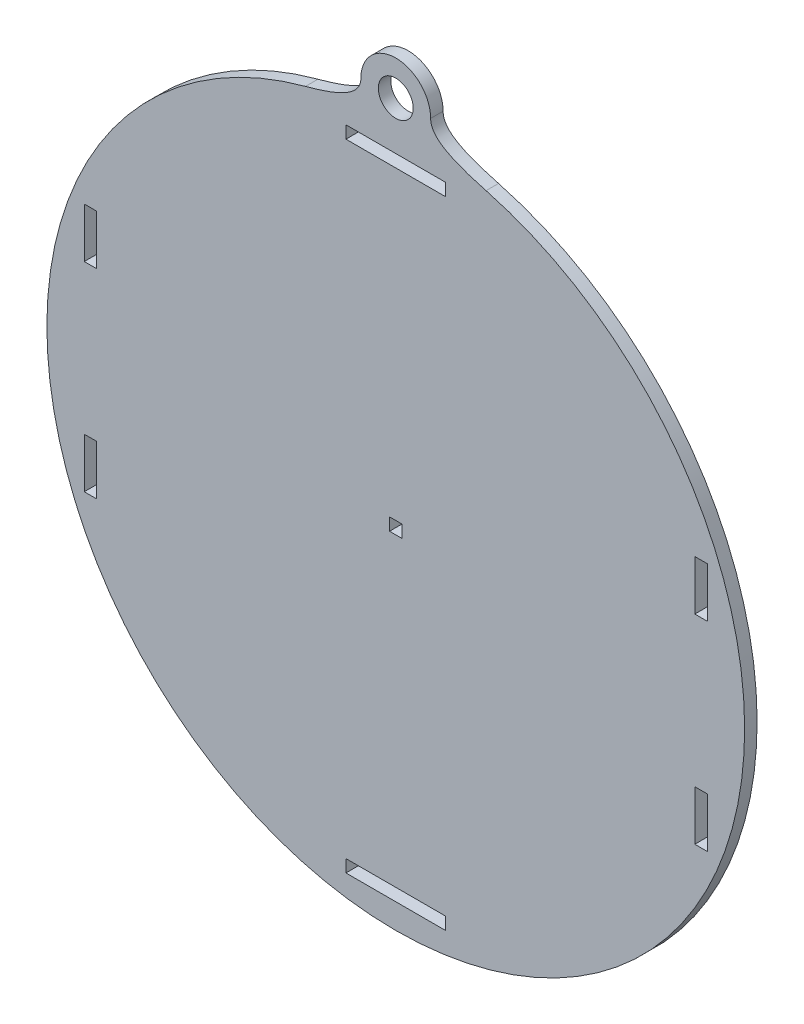
ISO-10303-21;
HEADER;
FILE_DESCRIPTION(('STEP AP214'),'2;1');
FILE_NAME('part.step','',(''),(''),'','','');
FILE_SCHEMA(('AUTOMOTIVE_DESIGN { 1 0 10303 214 1 1 1 1 }'));
ENDSEC;
DATA;
#1=APPLICATION_CONTEXT('core data for automotive mechanical design processes');
#2=APPLICATION_PROTOCOL_DEFINITION('international standard','automotive_design',2000,#1);
#3=PRODUCT_CONTEXT('',#1,'mechanical');
#4=PRODUCT('Part','Part','',(#3));
#5=PRODUCT_RELATED_PRODUCT_CATEGORY('part','',(#4));
#6=PRODUCT_DEFINITION_FORMATION('','',#4);
#7=PRODUCT_DEFINITION_CONTEXT('part definition',#1,'design');
#8=PRODUCT_DEFINITION('design','',#6,#7);
#9=PRODUCT_DEFINITION_SHAPE('','',#8);
#10=(LENGTH_UNIT() NAMED_UNIT(*) SI_UNIT(.MILLI.,.METRE.));
#11=(NAMED_UNIT(*) PLANE_ANGLE_UNIT() SI_UNIT($,.RADIAN.));
#12=(NAMED_UNIT(*) SI_UNIT($,.STERADIAN.) SOLID_ANGLE_UNIT());
#13=UNCERTAINTY_MEASURE_WITH_UNIT(LENGTH_MEASURE(1.E-05),#10,'distance_accuracy_value','');
#14=(GEOMETRIC_REPRESENTATION_CONTEXT(3) GLOBAL_UNCERTAINTY_ASSIGNED_CONTEXT((#13)) GLOBAL_UNIT_ASSIGNED_CONTEXT((#10,
#11,#12)) REPRESENTATION_CONTEXT('',''));
#15=CARTESIAN_POINT('',(0.,0.,0.));
#16=DIRECTION('',(0.,0.,1.));
#17=DIRECTION('',(1.,0.,0.));
#18=AXIS2_PLACEMENT_3D('',#15,#16,#17);
#19=CARTESIAN_POINT('',(-12.8826920563394,89.5500564252986,3.175));
#20=DIRECTION('',(0.,0.,-1.));
#21=DIRECTION('',(-1.,0.,0.));
#22=AXIS2_PLACEMENT_3D('',#19,#20,#21);
#23=PLANE('',#22);
#24=DIRECTION('',(-1.,0.,0.));
#25=VECTOR('',#24,1.);
#26=CARTESIAN_POINT('',(-12.7,-79.375,3.175));
#27=LINE('',#26,#25);
#28=CARTESIAN_POINT('',(12.7,-79.375,3.175));
#29=VERTEX_POINT('',#28);
#30=CARTESIAN_POINT('',(-12.7,-79.375,3.175));
#31=VERTEX_POINT('',#30);
#32=EDGE_CURVE('E244',#29,#31,#27,.T.);
#33=ORIENTED_EDGE('',*,*,#32,.F.);
#34=DIRECTION('',(0.,1.,0.));
#35=VECTOR('',#34,1.);
#36=CARTESIAN_POINT('',(12.7,-79.375,3.175));
#37=LINE('',#36,#35);
#38=CARTESIAN_POINT('',(12.7,-82.55,3.175));
#39=VERTEX_POINT('',#38);
#40=EDGE_CURVE('E267',#39,#29,#37,.T.);
#41=ORIENTED_EDGE('',*,*,#40,.F.);
#42=DIRECTION('',(1.,0.,0.));
#43=VECTOR('',#42,1.);
#44=CARTESIAN_POINT('',(-12.7,-82.55,3.175));
#45=LINE('',#44,#43);
#46=CARTESIAN_POINT('',(-12.7,-82.55,3.175));
#47=VERTEX_POINT('',#46);
#48=EDGE_CURVE('E265',#47,#39,#45,.T.);
#49=ORIENTED_EDGE('',*,*,#48,.F.);
#50=DIRECTION('',(0.,-1.,0.));
#51=VECTOR('',#50,1.);
#52=CARTESIAN_POINT('',(-12.7,-79.375,3.175));
#53=LINE('',#52,#51);
#54=EDGE_CURVE('E252',#31,#47,#53,.T.);
#55=ORIENTED_EDGE('',*,*,#54,.F.);
#56=EDGE_LOOP('',(#33,#41,#49,#55));
#57=FACE_BOUND('',#56,.T.);
#58=DIRECTION('',(0.,-1.,0.));
#59=VECTOR('',#58,1.);
#60=CARTESIAN_POINT('',(-79.375,31.73476,3.175));
#61=LINE('',#60,#59);
#62=CARTESIAN_POINT('',(-79.375,31.73476,3.175));
#63=VERTEX_POINT('',#62);
#64=CARTESIAN_POINT('',(-79.375,19.0347599999999,3.175));
#65=VERTEX_POINT('',#64);
#66=EDGE_CURVE('E314',#63,#65,#61,.T.);
#67=ORIENTED_EDGE('',*,*,#66,.F.);
#68=DIRECTION('',(-1.,0.,0.));
#69=VECTOR('',#68,1.);
#70=CARTESIAN_POINT('',(-79.375,31.73476,3.175));
#71=LINE('',#70,#69);
#72=CARTESIAN_POINT('',(-76.2,31.73476,3.175));
#73=VERTEX_POINT('',#72);
#74=EDGE_CURVE('E322',#73,#63,#71,.T.);
#75=ORIENTED_EDGE('',*,*,#74,.F.);
#76=DIRECTION('',(0.,1.,0.));
#77=VECTOR('',#76,1.);
#78=CARTESIAN_POINT('',(-76.2,31.73476,3.175));
#79=LINE('',#78,#77);
#80=CARTESIAN_POINT('',(-76.2,19.03476,3.175));
#81=VERTEX_POINT('',#80);
#82=EDGE_CURVE('E319',#81,#73,#79,.T.);
#83=ORIENTED_EDGE('',*,*,#82,.F.);
#84=DIRECTION('',(1.,0.,0.));
#85=VECTOR('',#84,1.);
#86=CARTESIAN_POINT('',(-79.375,19.0347599999999,3.175));
#87=LINE('',#86,#85);
#88=EDGE_CURVE('E316',#65,#81,#87,.T.);
#89=ORIENTED_EDGE('',*,*,#88,.F.);
#90=EDGE_LOOP('',(#67,#75,#83,#89));
#91=FACE_BOUND('',#90,.T.);
#92=DIRECTION('',(0.,1.,0.));
#93=VECTOR('',#92,1.);
#94=CARTESIAN_POINT('',(79.375,-19.06524,3.175));
#95=LINE('',#94,#93);
#96=CARTESIAN_POINT('',(79.3749999999999,-31.76524,3.175));
#97=VERTEX_POINT('',#96);
#98=CARTESIAN_POINT('',(79.375,-19.06524,3.175));
#99=VERTEX_POINT('',#98);
#100=EDGE_CURVE('E376',#97,#99,#95,.T.);
#101=ORIENTED_EDGE('',*,*,#100,.F.);
#102=DIRECTION('',(1.,0.,0.));
#103=VECTOR('',#102,1.);
#104=CARTESIAN_POINT('',(79.3749999999999,-31.76524,3.175));
#105=LINE('',#104,#103);
#106=CARTESIAN_POINT('',(76.2,-31.76524,3.175));
#107=VERTEX_POINT('',#106);
#108=EDGE_CURVE('E384',#107,#97,#105,.T.);
#109=ORIENTED_EDGE('',*,*,#108,.F.);
#110=DIRECTION('',(0.,-1.,0.));
#111=VECTOR('',#110,1.);
#112=CARTESIAN_POINT('',(76.2,-19.06524,3.175));
#113=LINE('',#112,#111);
#114=CARTESIAN_POINT('',(76.2,-19.06524,3.175));
#115=VERTEX_POINT('',#114);
#116=EDGE_CURVE('E381',#115,#107,#113,.T.);
#117=ORIENTED_EDGE('',*,*,#116,.F.);
#118=DIRECTION('',(-1.,0.,0.));
#119=VECTOR('',#118,1.);
#120=CARTESIAN_POINT('',(79.375,-19.06524,3.175));
#121=LINE('',#120,#119);
#122=EDGE_CURVE('E378',#99,#115,#121,.T.);
#123=ORIENTED_EDGE('',*,*,#122,.F.);
#124=EDGE_LOOP('',(#101,#109,#117,#123));
#125=FACE_BOUND('',#124,.T.);
#126=DIRECTION('',(0.,1.,0.));
#127=VECTOR('',#126,1.);
#128=CARTESIAN_POINT('',(1.5875,-1.5875,3.175));
#129=LINE('',#128,#127);
#130=CARTESIAN_POINT('',(1.5875,-1.5875,3.175));
#131=VERTEX_POINT('',#130);
#132=CARTESIAN_POINT('',(1.5875,1.5875,3.175));
#133=VERTEX_POINT('',#132);
#134=EDGE_CURVE('E438',#131,#133,#129,.T.);
#135=ORIENTED_EDGE('',*,*,#134,.F.);
#136=DIRECTION('',(1.,0.,0.));
#137=VECTOR('',#136,1.);
#138=CARTESIAN_POINT('',(-1.5875,-1.5875,3.175));
#139=LINE('',#138,#137);
#140=CARTESIAN_POINT('',(-1.5875,-1.58750000000001,3.175));
#141=VERTEX_POINT('',#140);
#142=EDGE_CURVE('E446',#141,#131,#139,.T.);
#143=ORIENTED_EDGE('',*,*,#142,.F.);
#144=DIRECTION('',(0.,-1.,0.));
#145=VECTOR('',#144,1.);
#146=CARTESIAN_POINT('',(-1.5875,-1.5875,3.175));
#147=LINE('',#146,#145);
#148=CARTESIAN_POINT('',(-1.5875,1.5875,3.175));
#149=VERTEX_POINT('',#148);
#150=EDGE_CURVE('E443',#149,#141,#147,.T.);
#151=ORIENTED_EDGE('',*,*,#150,.F.);
#152=DIRECTION('',(-1.,0.,0.));
#153=VECTOR('',#152,1.);
#154=CARTESIAN_POINT('',(-1.5875,1.5875,3.175));
#155=LINE('',#154,#153);
#156=EDGE_CURVE('E440',#133,#149,#155,.T.);
#157=ORIENTED_EDGE('',*,*,#156,.F.);
#158=EDGE_LOOP('',(#135,#143,#151,#157));
#159=FACE_BOUND('',#158,.T.);
#160=CARTESIAN_POINT('',(-8.89,94.7608059570981,3.175));
#161=CARTESIAN_POINT('',(-8.88999999999996,90.5274726237649,3.175));
#162=CARTESIAN_POINT('',(-14.8308411137003,88.0621405389661,3.175));
#163=CARTESIAN_POINT('',(-23.0090131096144,85.8708059570981,3.175));
#164=B_SPLINE_CURVE_WITH_KNOTS('',3,(#160,#161,#162,#163),.UNSPECIFIED.,.F.,.F.,(4,4),(0.,1.),.UNSPECIFIED.);
#165=CARTESIAN_POINT('',(-8.89,94.7608059570981,3.175));
#166=VERTEX_POINT('',#165);
#167=CARTESIAN_POINT('',(-23.0090131096144,85.8708059570981,3.175));
#168=VERTEX_POINT('',#167);
#169=EDGE_CURVE('E468',#166,#168,#164,.T.);
#170=ORIENTED_EDGE('',*,*,#169,.T.);
#171=CARTESIAN_POINT('',(0.,0.,3.175));
#172=DIRECTION('',(0.,0.,1.));
#173=DIRECTION('',(1.,0.,0.));
#174=AXIS2_PLACEMENT_3D('',#171,#172,#173);
#175=CIRCLE('',#174,88.9);
#176=CARTESIAN_POINT('',(23.0090131096145,85.8708059570981,3.175));
#177=VERTEX_POINT('',#176);
#178=EDGE_CURVE('E474',#168,#177,#175,.T.);
#179=ORIENTED_EDGE('',*,*,#178,.T.);
#180=CARTESIAN_POINT('',(23.0090131096145,85.8708059570981,3.175));
#181=CARTESIAN_POINT('',(14.8308411137004,88.0621405389661,3.175));
#182=CARTESIAN_POINT('',(8.88999999999998,90.5274726237648,3.175));
#183=CARTESIAN_POINT('',(8.89,94.7608059570981,3.175));
#184=B_SPLINE_CURVE_WITH_KNOTS('',3,(#180,#181,#182,#183),.UNSPECIFIED.,.F.,.F.,(4,4),(0.,1.),.UNSPECIFIED.);
#185=CARTESIAN_POINT('',(8.89,94.7608059570981,3.175));
#186=VERTEX_POINT('',#185);
#187=EDGE_CURVE('E480',#177,#186,#184,.T.);
#188=ORIENTED_EDGE('',*,*,#187,.T.);
#189=CARTESIAN_POINT('',(0.,94.7608059570981,3.175));
#190=DIRECTION('',(0.,0.,1.));
#191=DIRECTION('',(-1.,0.,0.));
#192=AXIS2_PLACEMENT_3D('',#189,#190,#191);
#193=CIRCLE('',#192,8.89);
#194=EDGE_CURVE('E485',#186,#166,#193,.T.);
#195=ORIENTED_EDGE('',*,*,#194,.T.);
#196=EDGE_LOOP('',(#170,#179,#188,#195));
#197=FACE_BOUND('',#196,.T.);
#198=DIRECTION('',(0.,1.,0.));
#199=VECTOR('',#198,1.);
#200=CARTESIAN_POINT('',(79.375,31.73476,3.175));
#201=LINE('',#200,#199);
#202=CARTESIAN_POINT('',(79.375,19.0347599999999,3.175));
#203=VERTEX_POINT('',#202);
#204=CARTESIAN_POINT('',(79.375,31.73476,3.175));
#205=VERTEX_POINT('',#204);
#206=EDGE_CURVE('E407',#203,#205,#201,.T.);
#207=ORIENTED_EDGE('',*,*,#206,.F.);
#208=DIRECTION('',(1.,0.,0.));
#209=VECTOR('',#208,1.);
#210=CARTESIAN_POINT('',(79.375,19.0347599999999,3.175));
#211=LINE('',#210,#209);
#212=CARTESIAN_POINT('',(76.2,19.03476,3.175));
#213=VERTEX_POINT('',#212);
#214=EDGE_CURVE('E415',#213,#203,#211,.T.);
#215=ORIENTED_EDGE('',*,*,#214,.F.);
#216=DIRECTION('',(0.,-1.,0.));
#217=VECTOR('',#216,1.);
#218=CARTESIAN_POINT('',(76.2,31.73476,3.175));
#219=LINE('',#218,#217);
#220=CARTESIAN_POINT('',(76.2,31.73476,3.175));
#221=VERTEX_POINT('',#220);
#222=EDGE_CURVE('E412',#221,#213,#219,.T.);
#223=ORIENTED_EDGE('',*,*,#222,.F.);
#224=DIRECTION('',(-1.,0.,0.));
#225=VECTOR('',#224,1.);
#226=CARTESIAN_POINT('',(79.375,31.73476,3.175));
#227=LINE('',#226,#225);
#228=EDGE_CURVE('E409',#205,#221,#227,.T.);
#229=ORIENTED_EDGE('',*,*,#228,.F.);
#230=EDGE_LOOP('',(#207,#215,#223,#229));
#231=FACE_BOUND('',#230,.T.);
#232=DIRECTION('',(0.,-1.,0.));
#233=VECTOR('',#232,1.);
#234=CARTESIAN_POINT('',(-79.375,-19.06524,3.175));
#235=LINE('',#234,#233);
#236=CARTESIAN_POINT('',(-79.375,-19.06524,3.175));
#237=VERTEX_POINT('',#236);
#238=CARTESIAN_POINT('',(-79.3749999999999,-31.76524,3.175));
#239=VERTEX_POINT('',#238);
#240=EDGE_CURVE('E345',#237,#239,#235,.T.);
#241=ORIENTED_EDGE('',*,*,#240,.F.);
#242=DIRECTION('',(-1.,0.,0.));
#243=VECTOR('',#242,1.);
#244=CARTESIAN_POINT('',(-79.375,-19.06524,3.175));
#245=LINE('',#244,#243);
#246=CARTESIAN_POINT('',(-76.2,-19.06524,3.175));
#247=VERTEX_POINT('',#246);
#248=EDGE_CURVE('E353',#247,#237,#245,.T.);
#249=ORIENTED_EDGE('',*,*,#248,.F.);
#250=DIRECTION('',(0.,1.,0.));
#251=VECTOR('',#250,1.);
#252=CARTESIAN_POINT('',(-76.2,-19.06524,3.175));
#253=LINE('',#252,#251);
#254=CARTESIAN_POINT('',(-76.2,-31.76524,3.175));
#255=VERTEX_POINT('',#254);
#256=EDGE_CURVE('E350',#255,#247,#253,.T.);
#257=ORIENTED_EDGE('',*,*,#256,.F.);
#258=DIRECTION('',(1.,0.,0.));
#259=VECTOR('',#258,1.);
#260=CARTESIAN_POINT('',(-79.3749999999999,-31.76524,3.175));
#261=LINE('',#260,#259);
#262=EDGE_CURVE('E347',#239,#255,#261,.T.);
#263=ORIENTED_EDGE('',*,*,#262,.F.);
#264=EDGE_LOOP('',(#241,#249,#257,#263));
#265=FACE_BOUND('',#264,.T.);
#266=DIRECTION('',(-1.,0.,0.));
#267=VECTOR('',#266,1.);
#268=CARTESIAN_POINT('',(-12.7,82.55,3.175));
#269=LINE('',#268,#267);
#270=CARTESIAN_POINT('',(12.7,82.55,3.175));
#271=VERTEX_POINT('',#270);
#272=CARTESIAN_POINT('',(-12.7,82.55,3.175));
#273=VERTEX_POINT('',#272);
#274=EDGE_CURVE('E283',#271,#273,#269,.T.);
#275=ORIENTED_EDGE('',*,*,#274,.F.);
#276=DIRECTION('',(0.,1.,0.));
#277=VECTOR('',#276,1.);
#278=CARTESIAN_POINT('',(12.7,82.55,3.175));
#279=LINE('',#278,#277);
#280=CARTESIAN_POINT('',(12.7,79.375,3.175));
#281=VERTEX_POINT('',#280);
#282=EDGE_CURVE('E291',#281,#271,#279,.T.);
#283=ORIENTED_EDGE('',*,*,#282,.F.);
#284=DIRECTION('',(1.,0.,0.));
#285=VECTOR('',#284,1.);
#286=CARTESIAN_POINT('',(-12.7,79.375,3.175));
#287=LINE('',#286,#285);
#288=CARTESIAN_POINT('',(-12.7,79.375,3.175));
#289=VERTEX_POINT('',#288);
#290=EDGE_CURVE('E288',#289,#281,#287,.T.);
#291=ORIENTED_EDGE('',*,*,#290,.F.);
#292=DIRECTION('',(0.,-1.,0.));
#293=VECTOR('',#292,1.);
#294=CARTESIAN_POINT('',(-12.7,82.55,3.175));
#295=LINE('',#294,#293);
#296=EDGE_CURVE('E285',#273,#289,#295,.T.);
#297=ORIENTED_EDGE('',*,*,#296,.F.);
#298=EDGE_LOOP('',(#275,#283,#291,#297));
#299=FACE_BOUND('',#298,.T.);
#300=CARTESIAN_POINT('',(0.,94.7608059570981,3.175));
#301=DIRECTION('',(0.,0.,1.));
#302=DIRECTION('',(1.,0.,0.));
#303=AXIS2_PLACEMENT_3D('',#300,#301,#302);
#304=CIRCLE('',#303,4.445);
#305=CARTESIAN_POINT('',(4.445,94.7608059570981,3.175));
#306=VERTEX_POINT('',#305);
#307=EDGE_CURVE('E273',#306,#306,#304,.T.);
#308=ORIENTED_EDGE('',*,*,#307,.F.);
#309=EDGE_LOOP('',(#308));
#310=FACE_BOUND('',#309,.T.);
#311=ADVANCED_FACE('F34',(#57,#91,#125,#159,#197,#231,#265,#299,#310),#23,.F.);
#312=CARTESIAN_POINT('',(-12.8826920563394,89.5500564252986,0.));
#313=DIRECTION('',(0.,0.,-1.));
#314=DIRECTION('',(-1.,0.,0.));
#315=AXIS2_PLACEMENT_3D('',#312,#313,#314);
#316=PLANE('',#315);
#317=DIRECTION('',(0.,1.,0.));
#318=VECTOR('',#317,1.);
#319=CARTESIAN_POINT('',(12.7,-79.375,0.));
#320=LINE('',#319,#318);
#321=CARTESIAN_POINT('',(12.7,-82.55,0.));
#322=VERTEX_POINT('',#321);
#323=CARTESIAN_POINT('',(12.7,-79.375,0.));
#324=VERTEX_POINT('',#323);
#325=EDGE_CURVE('E253',#322,#324,#320,.T.);
#326=ORIENTED_EDGE('',*,*,#325,.T.);
#327=DIRECTION('',(-1.,0.,0.));
#328=VECTOR('',#327,1.);
#329=CARTESIAN_POINT('',(-12.7,-79.375,0.));
#330=LINE('',#329,#328);
#331=CARTESIAN_POINT('',(-12.7,-79.375,0.));
#332=VERTEX_POINT('',#331);
#333=EDGE_CURVE('E58',#324,#332,#330,.T.);
#334=ORIENTED_EDGE('',*,*,#333,.T.);
#335=DIRECTION('',(0.,-1.,0.));
#336=VECTOR('',#335,1.);
#337=CARTESIAN_POINT('',(-12.7,-79.375,0.));
#338=LINE('',#337,#336);
#339=CARTESIAN_POINT('',(-12.7,-82.55,0.));
#340=VERTEX_POINT('',#339);
#341=EDGE_CURVE('E259',#332,#340,#338,.T.);
#342=ORIENTED_EDGE('',*,*,#341,.T.);
#343=DIRECTION('',(1.,0.,0.));
#344=VECTOR('',#343,1.);
#345=CARTESIAN_POINT('',(-12.7,-82.55,0.));
#346=LINE('',#345,#344);
#347=EDGE_CURVE('E275',#340,#322,#346,.T.);
#348=ORIENTED_EDGE('',*,*,#347,.T.);
#349=EDGE_LOOP('',(#326,#334,#342,#348));
#350=FACE_BOUND('',#349,.T.);
#351=DIRECTION('',(-1.,0.,0.));
#352=VECTOR('',#351,1.);
#353=CARTESIAN_POINT('',(-79.375,31.73476,0.));
#354=LINE('',#353,#352);
#355=CARTESIAN_POINT('',(-76.2,31.73476,0.));
#356=VERTEX_POINT('',#355);
#357=CARTESIAN_POINT('',(-79.375,31.73476,0.));
#358=VERTEX_POINT('',#357);
#359=EDGE_CURVE('E317',#356,#358,#354,.T.);
#360=ORIENTED_EDGE('',*,*,#359,.T.);
#361=DIRECTION('',(0.,-1.,0.));
#362=VECTOR('',#361,1.);
#363=CARTESIAN_POINT('',(-79.375,31.73476,0.));
#364=LINE('',#363,#362);
#365=CARTESIAN_POINT('',(-79.375,19.0347599999999,0.));
#366=VERTEX_POINT('',#365);
#367=EDGE_CURVE('E313',#358,#366,#364,.T.);
#368=ORIENTED_EDGE('',*,*,#367,.T.);
#369=DIRECTION('',(1.,0.,0.));
#370=VECTOR('',#369,1.);
#371=CARTESIAN_POINT('',(-79.375,19.0347599999999,0.));
#372=LINE('',#371,#370);
#373=CARTESIAN_POINT('',(-76.2,19.03476,0.));
#374=VERTEX_POINT('',#373);
#375=EDGE_CURVE('E327',#366,#374,#372,.T.);
#376=ORIENTED_EDGE('',*,*,#375,.T.);
#377=DIRECTION('',(0.,1.,0.));
#378=VECTOR('',#377,1.);
#379=CARTESIAN_POINT('',(-76.2,31.73476,0.));
#380=LINE('',#379,#378);
#381=EDGE_CURVE('E330',#374,#356,#380,.T.);
#382=ORIENTED_EDGE('',*,*,#381,.T.);
#383=EDGE_LOOP('',(#360,#368,#376,#382));
#384=FACE_BOUND('',#383,.T.);
#385=DIRECTION('',(1.,0.,0.));
#386=VECTOR('',#385,1.);
#387=CARTESIAN_POINT('',(79.3749999999999,-31.76524,0.));
#388=LINE('',#387,#386);
#389=CARTESIAN_POINT('',(76.2,-31.76524,0.));
#390=VERTEX_POINT('',#389);
#391=CARTESIAN_POINT('',(79.3749999999999,-31.76524,0.));
#392=VERTEX_POINT('',#391);
#393=EDGE_CURVE('E379',#390,#392,#388,.T.);
#394=ORIENTED_EDGE('',*,*,#393,.T.);
#395=DIRECTION('',(0.,1.,0.));
#396=VECTOR('',#395,1.);
#397=CARTESIAN_POINT('',(79.375,-19.06524,0.));
#398=LINE('',#397,#396);
#399=CARTESIAN_POINT('',(79.375,-19.06524,0.));
#400=VERTEX_POINT('',#399);
#401=EDGE_CURVE('E375',#392,#400,#398,.T.);
#402=ORIENTED_EDGE('',*,*,#401,.T.);
#403=DIRECTION('',(-1.,0.,0.));
#404=VECTOR('',#403,1.);
#405=CARTESIAN_POINT('',(79.375,-19.06524,0.));
#406=LINE('',#405,#404);
#407=CARTESIAN_POINT('',(76.2,-19.06524,0.));
#408=VERTEX_POINT('',#407);
#409=EDGE_CURVE('E389',#400,#408,#406,.T.);
#410=ORIENTED_EDGE('',*,*,#409,.T.);
#411=DIRECTION('',(0.,-1.,0.));
#412=VECTOR('',#411,1.);
#413=CARTESIAN_POINT('',(76.2,-19.06524,0.));
#414=LINE('',#413,#412);
#415=EDGE_CURVE('E392',#408,#390,#414,.T.);
#416=ORIENTED_EDGE('',*,*,#415,.T.);
#417=EDGE_LOOP('',(#394,#402,#410,#416));
#418=FACE_BOUND('',#417,.T.);
#419=DIRECTION('',(1.,0.,0.));
#420=VECTOR('',#419,1.);
#421=CARTESIAN_POINT('',(-1.5875,-1.5875,0.));
#422=LINE('',#421,#420);
#423=CARTESIAN_POINT('',(-1.5875,-1.5875,0.));
#424=VERTEX_POINT('',#423);
#425=CARTESIAN_POINT('',(1.5875,-1.58750000000001,0.));
#426=VERTEX_POINT('',#425);
#427=EDGE_CURVE('E441',#424,#426,#422,.T.);
#428=ORIENTED_EDGE('',*,*,#427,.T.);
#429=DIRECTION('',(0.,1.,0.));
#430=VECTOR('',#429,1.);
#431=CARTESIAN_POINT('',(1.5875,-1.5875,0.));
#432=LINE('',#431,#430);
#433=CARTESIAN_POINT('',(1.5875,1.5875,0.));
#434=VERTEX_POINT('',#433);
#435=EDGE_CURVE('E437',#426,#434,#432,.T.);
#436=ORIENTED_EDGE('',*,*,#435,.T.);
#437=DIRECTION('',(-1.,0.,0.));
#438=VECTOR('',#437,1.);
#439=CARTESIAN_POINT('',(-1.5875,1.5875,0.));
#440=LINE('',#439,#438);
#441=CARTESIAN_POINT('',(-1.5875,1.5875,0.));
#442=VERTEX_POINT('',#441);
#443=EDGE_CURVE('E451',#434,#442,#440,.T.);
#444=ORIENTED_EDGE('',*,*,#443,.T.);
#445=DIRECTION('',(0.,-1.,0.));
#446=VECTOR('',#445,1.);
#447=CARTESIAN_POINT('',(-1.5875,-1.5875,0.));
#448=LINE('',#447,#446);
#449=EDGE_CURVE('E454',#442,#424,#448,.T.);
#450=ORIENTED_EDGE('',*,*,#449,.T.);
#451=EDGE_LOOP('',(#428,#436,#444,#450));
#452=FACE_BOUND('',#451,.T.);
#453=CARTESIAN_POINT('',(-8.89,94.7608059570981,0.));
#454=CARTESIAN_POINT('',(-8.88999999999996,90.5274726237649,0.));
#455=CARTESIAN_POINT('',(-14.8308411137003,88.0621405389661,0.));
#456=CARTESIAN_POINT('',(-23.0090131096144,85.8708059570981,0.));
#457=B_SPLINE_CURVE_WITH_KNOTS('',3,(#453,#454,#455,#456),.UNSPECIFIED.,.F.,.F.,(4,4),(0.,1.),.UNSPECIFIED.);
#458=CARTESIAN_POINT('',(-8.89,94.7608059570981,0.));
#459=VERTEX_POINT('',#458);
#460=CARTESIAN_POINT('',(-23.0090131096144,85.8708059570981,0.));
#461=VERTEX_POINT('',#460);
#462=EDGE_CURVE('E467',#459,#461,#457,.T.);
#463=ORIENTED_EDGE('',*,*,#462,.F.);
#464=CARTESIAN_POINT('',(0.,94.7608059570981,0.));
#465=DIRECTION('',(0.,0.,1.));
#466=DIRECTION('',(-1.,0.,0.));
#467=AXIS2_PLACEMENT_3D('',#464,#465,#466);
#468=CIRCLE('',#467,8.89);
#469=CARTESIAN_POINT('',(8.89,94.7608059570981,0.));
#470=VERTEX_POINT('',#469);
#471=EDGE_CURVE('E475',#470,#459,#468,.T.);
#472=ORIENTED_EDGE('',*,*,#471,.F.);
#473=CARTESIAN_POINT('',(23.0090131096145,85.8708059570981,0.));
#474=CARTESIAN_POINT('',(14.8308411137004,88.0621405389661,0.));
#475=CARTESIAN_POINT('',(8.88999999999998,90.5274726237648,0.));
#476=CARTESIAN_POINT('',(8.89,94.7608059570981,0.));
#477=B_SPLINE_CURVE_WITH_KNOTS('',3,(#473,#474,#475,#476),.UNSPECIFIED.,.F.,.F.,(4,4),(0.,1.),.UNSPECIFIED.);
#478=CARTESIAN_POINT('',(23.0090131096145,85.8708059570981,0.));
#479=VERTEX_POINT('',#478);
#480=EDGE_CURVE('E853',#479,#470,#477,.T.);
#481=ORIENTED_EDGE('',*,*,#480,.F.);
#482=CARTESIAN_POINT('',(0.,0.,0.));
#483=DIRECTION('',(0.,0.,1.));
#484=DIRECTION('',(1.,0.,0.));
#485=AXIS2_PLACEMENT_3D('',#482,#483,#484);
#486=CIRCLE('',#485,88.9);
#487=EDGE_CURVE('E859',#461,#479,#486,.T.);
#488=ORIENTED_EDGE('',*,*,#487,.F.);
#489=EDGE_LOOP('',(#463,#472,#481,#488));
#490=FACE_BOUND('',#489,.T.);
#491=DIRECTION('',(1.,0.,0.));
#492=VECTOR('',#491,1.);
#493=CARTESIAN_POINT('',(79.375,19.0347599999999,0.));
#494=LINE('',#493,#492);
#495=CARTESIAN_POINT('',(76.2,19.03476,0.));
#496=VERTEX_POINT('',#495);
#497=CARTESIAN_POINT('',(79.375,19.03476,0.));
#498=VERTEX_POINT('',#497);
#499=EDGE_CURVE('E410',#496,#498,#494,.T.);
#500=ORIENTED_EDGE('',*,*,#499,.T.);
#501=DIRECTION('',(0.,1.,0.));
#502=VECTOR('',#501,1.);
#503=CARTESIAN_POINT('',(79.375,31.73476,0.));
#504=LINE('',#503,#502);
#505=CARTESIAN_POINT('',(79.375,31.73476,0.));
#506=VERTEX_POINT('',#505);
#507=EDGE_CURVE('E406',#498,#506,#504,.T.);
#508=ORIENTED_EDGE('',*,*,#507,.T.);
#509=DIRECTION('',(-1.,0.,0.));
#510=VECTOR('',#509,1.);
#511=CARTESIAN_POINT('',(79.375,31.73476,0.));
#512=LINE('',#511,#510);
#513=CARTESIAN_POINT('',(76.2,31.73476,0.));
#514=VERTEX_POINT('',#513);
#515=EDGE_CURVE('E420',#506,#514,#512,.T.);
#516=ORIENTED_EDGE('',*,*,#515,.T.);
#517=DIRECTION('',(0.,-1.,0.));
#518=VECTOR('',#517,1.);
#519=CARTESIAN_POINT('',(76.2,31.73476,0.));
#520=LINE('',#519,#518);
#521=EDGE_CURVE('E423',#514,#496,#520,.T.);
#522=ORIENTED_EDGE('',*,*,#521,.T.);
#523=EDGE_LOOP('',(#500,#508,#516,#522));
#524=FACE_BOUND('',#523,.T.);
#525=DIRECTION('',(-1.,0.,0.));
#526=VECTOR('',#525,1.);
#527=CARTESIAN_POINT('',(-79.375,-19.06524,0.));
#528=LINE('',#527,#526);
#529=CARTESIAN_POINT('',(-76.2,-19.06524,0.));
#530=VERTEX_POINT('',#529);
#531=CARTESIAN_POINT('',(-79.375,-19.06524,0.));
#532=VERTEX_POINT('',#531);
#533=EDGE_CURVE('E348',#530,#532,#528,.T.);
#534=ORIENTED_EDGE('',*,*,#533,.T.);
#535=DIRECTION('',(0.,-1.,0.));
#536=VECTOR('',#535,1.);
#537=CARTESIAN_POINT('',(-79.375,-19.06524,0.));
#538=LINE('',#537,#536);
#539=CARTESIAN_POINT('',(-79.3749999999999,-31.76524,0.));
#540=VERTEX_POINT('',#539);
#541=EDGE_CURVE('E344',#532,#540,#538,.T.);
#542=ORIENTED_EDGE('',*,*,#541,.T.);
#543=DIRECTION('',(1.,0.,0.));
#544=VECTOR('',#543,1.);
#545=CARTESIAN_POINT('',(-79.3749999999999,-31.76524,0.));
#546=LINE('',#545,#544);
#547=CARTESIAN_POINT('',(-76.2,-31.76524,0.));
#548=VERTEX_POINT('',#547);
#549=EDGE_CURVE('E358',#540,#548,#546,.T.);
#550=ORIENTED_EDGE('',*,*,#549,.T.);
#551=DIRECTION('',(0.,1.,0.));
#552=VECTOR('',#551,1.);
#553=CARTESIAN_POINT('',(-76.2,-19.06524,0.));
#554=LINE('',#553,#552);
#555=EDGE_CURVE('E361',#548,#530,#554,.T.);
#556=ORIENTED_EDGE('',*,*,#555,.T.);
#557=EDGE_LOOP('',(#534,#542,#550,#556));
#558=FACE_BOUND('',#557,.T.);
#559=DIRECTION('',(0.,1.,0.));
#560=VECTOR('',#559,1.);
#561=CARTESIAN_POINT('',(12.7,82.55,0.));
#562=LINE('',#561,#560);
#563=CARTESIAN_POINT('',(12.7,79.375,0.));
#564=VERTEX_POINT('',#563);
#565=CARTESIAN_POINT('',(12.7,82.55,0.));
#566=VERTEX_POINT('',#565);
#567=EDGE_CURVE('E286',#564,#566,#562,.T.);
#568=ORIENTED_EDGE('',*,*,#567,.T.);
#569=DIRECTION('',(-1.,0.,0.));
#570=VECTOR('',#569,1.);
#571=CARTESIAN_POINT('',(-12.7,82.55,0.));
#572=LINE('',#571,#570);
#573=CARTESIAN_POINT('',(-12.7,82.55,0.));
#574=VERTEX_POINT('',#573);
#575=EDGE_CURVE('E260',#566,#574,#572,.T.);
#576=ORIENTED_EDGE('',*,*,#575,.T.);
#577=DIRECTION('',(0.,-1.,0.));
#578=VECTOR('',#577,1.);
#579=CARTESIAN_POINT('',(-12.7,82.55,0.));
#580=LINE('',#579,#578);
#581=CARTESIAN_POINT('',(-12.7,79.375,0.));
#582=VERTEX_POINT('',#581);
#583=EDGE_CURVE('E296',#574,#582,#580,.T.);
#584=ORIENTED_EDGE('',*,*,#583,.T.);
#585=DIRECTION('',(1.,0.,0.));
#586=VECTOR('',#585,1.);
#587=CARTESIAN_POINT('',(-12.7,79.375,0.));
#588=LINE('',#587,#586);
#589=EDGE_CURVE('E299',#582,#564,#588,.T.);
#590=ORIENTED_EDGE('',*,*,#589,.T.);
#591=EDGE_LOOP('',(#568,#576,#584,#590));
#592=FACE_BOUND('',#591,.T.);
#593=CARTESIAN_POINT('',(0.,94.7608059570981,0.));
#594=DIRECTION('',(0.,0.,1.));
#595=DIRECTION('',(1.,0.,0.));
#596=AXIS2_PLACEMENT_3D('',#593,#594,#595);
#597=CIRCLE('',#596,4.445);
#598=CARTESIAN_POINT('',(4.445,94.7608059570981,0.));
#599=VERTEX_POINT('',#598);
#600=EDGE_CURVE('E629',#599,#599,#597,.T.);
#601=ORIENTED_EDGE('',*,*,#600,.T.);
#602=EDGE_LOOP('',(#601));
#603=FACE_BOUND('',#602,.T.);
#604=ADVANCED_FACE('F503',(#350,#384,#418,#452,#490,#524,#558,#592,#603),#316,.T.);
#605=DIRECTION('',(0.,0.,-1.));
#606=VECTOR('',#605,1.);
#607=SURFACE_OF_LINEAR_EXTRUSION('',#164,#606);
#608=ORIENTED_EDGE('',*,*,#462,.T.);
#609=DIRECTION('',(0.,0.,-1.));
#610=VECTOR('',#609,1.);
#611=CARTESIAN_POINT('',(-23.0090131096144,85.8708059570981,3.175));
#612=LINE('',#611,#610);
#613=EDGE_CURVE('E11',#168,#461,#612,.T.);
#614=ORIENTED_EDGE('',*,*,#613,.F.);
#615=ORIENTED_EDGE('',*,*,#169,.F.);
#616=DIRECTION('',(0.,0.,-1.));
#617=VECTOR('',#616,1.);
#618=CARTESIAN_POINT('',(-8.89,94.7608059570981,3.175));
#619=LINE('',#618,#617);
#620=EDGE_CURVE('E846',#166,#459,#619,.T.);
#621=ORIENTED_EDGE('',*,*,#620,.T.);
#622=EDGE_LOOP('',(#608,#614,#615,#621));
#623=FACE_BOUND('',#622,.T.);
#624=ADVANCED_FACE('F36',(#623),#607,.F.);
#625=CARTESIAN_POINT('',(0.,0.,3.175));
#626=DIRECTION('',(0.,0.,-1.));
#627=DIRECTION('',(-1.,0.,0.));
#628=AXIS2_PLACEMENT_3D('',#625,#626,#627);
#629=CYLINDRICAL_SURFACE('',#628,88.9);
#630=ORIENTED_EDGE('',*,*,#487,.T.);
#631=DIRECTION('',(0.,0.,-1.));
#632=VECTOR('',#631,1.);
#633=CARTESIAN_POINT('',(23.0090131096145,85.8708059570981,3.175));
#634=LINE('',#633,#632);
#635=EDGE_CURVE('E43',#177,#479,#634,.T.);
#636=ORIENTED_EDGE('',*,*,#635,.F.);
#637=ORIENTED_EDGE('',*,*,#178,.F.);
#638=ORIENTED_EDGE('',*,*,#613,.T.);
#639=EDGE_LOOP('',(#630,#636,#637,#638));
#640=FACE_BOUND('',#639,.T.);
#641=ADVANCED_FACE('F495',(#640),#629,.T.);
#642=DIRECTION('',(0.,0.,-1.));
#643=VECTOR('',#642,1.);
#644=SURFACE_OF_LINEAR_EXTRUSION('',#184,#643);
#645=ORIENTED_EDGE('',*,*,#480,.T.);
#646=DIRECTION('',(0.,0.,-1.));
#647=VECTOR('',#646,1.);
#648=CARTESIAN_POINT('',(8.89,94.7608059570981,3.175));
#649=LINE('',#648,#647);
#650=EDGE_CURVE('E849',#186,#470,#649,.T.);
#651=ORIENTED_EDGE('',*,*,#650,.F.);
#652=ORIENTED_EDGE('',*,*,#187,.F.);
#653=ORIENTED_EDGE('',*,*,#635,.T.);
#654=EDGE_LOOP('',(#645,#651,#652,#653));
#655=FACE_BOUND('',#654,.T.);
#656=ADVANCED_FACE('F491',(#655),#644,.F.);
#657=CARTESIAN_POINT('',(0.,94.7608059570981,3.175));
#658=DIRECTION('',(0.,0.,-1.));
#659=DIRECTION('',(-1.,0.,0.));
#660=AXIS2_PLACEMENT_3D('',#657,#658,#659);
#661=CYLINDRICAL_SURFACE('',#660,8.89);
#662=ORIENTED_EDGE('',*,*,#471,.T.);
#663=ORIENTED_EDGE('',*,*,#620,.F.);
#664=ORIENTED_EDGE('',*,*,#194,.F.);
#665=ORIENTED_EDGE('',*,*,#650,.T.);
#666=EDGE_LOOP('',(#662,#663,#664,#665));
#667=FACE_BOUND('',#666,.T.);
#668=ADVANCED_FACE('F494',(#667),#661,.T.);
#669=CARTESIAN_POINT('',(1.5875,-1.5875,3.175));
#670=DIRECTION('',(-1.,0.,0.));
#671=DIRECTION('',(0.,0.,1.));
#672=AXIS2_PLACEMENT_3D('',#669,#670,#671);
#673=PLANE('',#672);
#674=ORIENTED_EDGE('',*,*,#435,.F.);
#675=DIRECTION('',(0.,0.,-1.));
#676=VECTOR('',#675,1.);
#677=CARTESIAN_POINT('',(1.5875,-1.5875,3.175));
#678=LINE('',#677,#676);
#679=EDGE_CURVE('E448',#131,#426,#678,.T.);
#680=ORIENTED_EDGE('',*,*,#679,.F.);
#681=ORIENTED_EDGE('',*,*,#134,.T.);
#682=DIRECTION('',(0.,0.,-1.));
#683=VECTOR('',#682,1.);
#684=CARTESIAN_POINT('',(1.5875,1.5875,3.175));
#685=LINE('',#684,#683);
#686=EDGE_CURVE('E465',#133,#434,#685,.T.);
#687=ORIENTED_EDGE('',*,*,#686,.T.);
#688=EDGE_LOOP('',(#674,#680,#681,#687));
#689=FACE_BOUND('',#688,.T.);
#690=ADVANCED_FACE('F512',(#689),#673,.T.);
#691=CARTESIAN_POINT('',(-1.5875,1.5875,3.175));
#692=DIRECTION('',(0.,-1.,0.));
#693=DIRECTION('',(0.,0.,-1.));
#694=AXIS2_PLACEMENT_3D('',#691,#692,#693);
#695=PLANE('',#694);
#696=ORIENTED_EDGE('',*,*,#443,.F.);
#697=ORIENTED_EDGE('',*,*,#686,.F.);
#698=ORIENTED_EDGE('',*,*,#156,.T.);
#699=DIRECTION('',(0.,0.,-1.));
#700=VECTOR('',#699,1.);
#701=CARTESIAN_POINT('',(-1.5875,1.5875,3.175));
#702=LINE('',#701,#700);
#703=EDGE_CURVE('E463',#149,#442,#702,.T.);
#704=ORIENTED_EDGE('',*,*,#703,.T.);
#705=EDGE_LOOP('',(#696,#697,#698,#704));
#706=FACE_BOUND('',#705,.T.);
#707=ADVANCED_FACE('F515',(#706),#695,.T.);
#708=CARTESIAN_POINT('',(-1.5875,-1.5875,3.175));
#709=DIRECTION('',(1.,0.,0.));
#710=DIRECTION('',(0.,0.,-1.));
#711=AXIS2_PLACEMENT_3D('',#708,#709,#710);
#712=PLANE('',#711);
#713=ORIENTED_EDGE('',*,*,#449,.F.);
#714=ORIENTED_EDGE('',*,*,#703,.F.);
#715=ORIENTED_EDGE('',*,*,#150,.T.);
#716=DIRECTION('',(0.,0.,-1.));
#717=VECTOR('',#716,1.);
#718=CARTESIAN_POINT('',(-1.5875,-1.5875,3.175));
#719=LINE('',#718,#717);
#720=EDGE_CURVE('E461',#141,#424,#719,.T.);
#721=ORIENTED_EDGE('',*,*,#720,.T.);
#722=EDGE_LOOP('',(#713,#714,#715,#721));
#723=FACE_BOUND('',#722,.T.);
#724=ADVANCED_FACE('F519',(#723),#712,.T.);
#725=CARTESIAN_POINT('',(-1.5875,-1.5875,3.175));
#726=DIRECTION('',(0.,1.,0.));
#727=DIRECTION('',(0.,0.,1.));
#728=AXIS2_PLACEMENT_3D('',#725,#726,#727);
#729=PLANE('',#728);
#730=ORIENTED_EDGE('',*,*,#427,.F.);
#731=ORIENTED_EDGE('',*,*,#720,.F.);
#732=ORIENTED_EDGE('',*,*,#142,.T.);
#733=ORIENTED_EDGE('',*,*,#679,.T.);
#734=EDGE_LOOP('',(#730,#731,#732,#733));
#735=FACE_BOUND('',#734,.T.);
#736=ADVANCED_FACE('F523',(#735),#729,.T.);
#737=CARTESIAN_POINT('',(79.375,31.73476,3.175));
#738=DIRECTION('',(-1.,0.,0.));
#739=DIRECTION('',(0.,0.,1.));
#740=AXIS2_PLACEMENT_3D('',#737,#738,#739);
#741=PLANE('',#740);
#742=ORIENTED_EDGE('',*,*,#507,.F.);
#743=DIRECTION('',(0.,0.,-1.));
#744=VECTOR('',#743,1.);
#745=CARTESIAN_POINT('',(79.375,19.0347599999999,3.175));
#746=LINE('',#745,#744);
#747=EDGE_CURVE('E417',#203,#498,#746,.T.);
#748=ORIENTED_EDGE('',*,*,#747,.F.);
#749=ORIENTED_EDGE('',*,*,#206,.T.);
#750=DIRECTION('',(0.,0.,-1.));
#751=VECTOR('',#750,1.);
#752=CARTESIAN_POINT('',(79.375,31.73476,3.175));
#753=LINE('',#752,#751);
#754=EDGE_CURVE('E434',#205,#506,#753,.T.);
#755=ORIENTED_EDGE('',*,*,#754,.T.);
#756=EDGE_LOOP('',(#742,#748,#749,#755));
#757=FACE_BOUND('',#756,.T.);
#758=ADVANCED_FACE('F527',(#757),#741,.T.);
#759=CARTESIAN_POINT('',(79.375,31.73476,3.175));
#760=DIRECTION('',(0.,-1.,0.));
#761=DIRECTION('',(0.,0.,-1.));
#762=AXIS2_PLACEMENT_3D('',#759,#760,#761);
#763=PLANE('',#762);
#764=ORIENTED_EDGE('',*,*,#515,.F.);
#765=ORIENTED_EDGE('',*,*,#754,.F.);
#766=ORIENTED_EDGE('',*,*,#228,.T.);
#767=DIRECTION('',(0.,0.,-1.));
#768=VECTOR('',#767,1.);
#769=CARTESIAN_POINT('',(76.2,31.73476,3.175));
#770=LINE('',#769,#768);
#771=EDGE_CURVE('E432',#221,#514,#770,.T.);
#772=ORIENTED_EDGE('',*,*,#771,.T.);
#773=EDGE_LOOP('',(#764,#765,#766,#772));
#774=FACE_BOUND('',#773,.T.);
#775=ADVANCED_FACE('F531',(#774),#763,.T.);
#776=CARTESIAN_POINT('',(76.2,31.73476,3.175));
#777=DIRECTION('',(1.,0.,0.));
#778=DIRECTION('',(0.,0.,-1.));
#779=AXIS2_PLACEMENT_3D('',#776,#777,#778);
#780=PLANE('',#779);
#781=ORIENTED_EDGE('',*,*,#521,.F.);
#782=ORIENTED_EDGE('',*,*,#771,.F.);
#783=ORIENTED_EDGE('',*,*,#222,.T.);
#784=DIRECTION('',(0.,0.,-1.));
#785=VECTOR('',#784,1.);
#786=CARTESIAN_POINT('',(76.2,19.03476,3.175));
#787=LINE('',#786,#785);
#788=EDGE_CURVE('E430',#213,#496,#787,.T.);
#789=ORIENTED_EDGE('',*,*,#788,.T.);
#790=EDGE_LOOP('',(#781,#782,#783,#789));
#791=FACE_BOUND('',#790,.T.);
#792=ADVANCED_FACE('F535',(#791),#780,.T.);
#793=CARTESIAN_POINT('',(79.375,19.0347599999999,3.175));
#794=DIRECTION('',(0.,1.,0.));
#795=DIRECTION('',(-1.,0.,0.));
#796=AXIS2_PLACEMENT_3D('',#793,#794,#795);
#797=PLANE('',#796);
#798=ORIENTED_EDGE('',*,*,#499,.F.);
#799=ORIENTED_EDGE('',*,*,#788,.F.);
#800=ORIENTED_EDGE('',*,*,#214,.T.);
#801=ORIENTED_EDGE('',*,*,#747,.T.);
#802=EDGE_LOOP('',(#798,#799,#800,#801));
#803=FACE_BOUND('',#802,.T.);
#804=ADVANCED_FACE('F539',(#803),#797,.T.);
#805=CARTESIAN_POINT('',(79.375,-19.06524,3.175));
#806=DIRECTION('',(-1.,0.,0.));
#807=DIRECTION('',(0.,-1.,0.));
#808=AXIS2_PLACEMENT_3D('',#805,#806,#807);
#809=PLANE('',#808);
#810=ORIENTED_EDGE('',*,*,#401,.F.);
#811=DIRECTION('',(0.,0.,-1.));
#812=VECTOR('',#811,1.);
#813=CARTESIAN_POINT('',(79.3749999999999,-31.76524,3.175));
#814=LINE('',#813,#812);
#815=EDGE_CURVE('E386',#97,#392,#814,.T.);
#816=ORIENTED_EDGE('',*,*,#815,.F.);
#817=ORIENTED_EDGE('',*,*,#100,.T.);
#818=DIRECTION('',(0.,0.,-1.));
#819=VECTOR('',#818,1.);
#820=CARTESIAN_POINT('',(79.375,-19.06524,3.175));
#821=LINE('',#820,#819);
#822=EDGE_CURVE('E403',#99,#400,#821,.T.);
#823=ORIENTED_EDGE('',*,*,#822,.T.);
#824=EDGE_LOOP('',(#810,#816,#817,#823));
#825=FACE_BOUND('',#824,.T.);
#826=ADVANCED_FACE('F543',(#825),#809,.T.);
#827=CARTESIAN_POINT('',(79.375,-19.06524,3.175));
#828=DIRECTION('',(0.,-1.,0.));
#829=DIRECTION('',(0.,0.,-1.));
#830=AXIS2_PLACEMENT_3D('',#827,#828,#829);
#831=PLANE('',#830);
#832=ORIENTED_EDGE('',*,*,#409,.F.);
#833=ORIENTED_EDGE('',*,*,#822,.F.);
#834=ORIENTED_EDGE('',*,*,#122,.T.);
#835=DIRECTION('',(0.,0.,-1.));
#836=VECTOR('',#835,1.);
#837=CARTESIAN_POINT('',(76.2,-19.06524,3.175));
#838=LINE('',#837,#836);
#839=EDGE_CURVE('E401',#115,#408,#838,.T.);
#840=ORIENTED_EDGE('',*,*,#839,.T.);
#841=EDGE_LOOP('',(#832,#833,#834,#840));
#842=FACE_BOUND('',#841,.T.);
#843=ADVANCED_FACE('F547',(#842),#831,.T.);
#844=CARTESIAN_POINT('',(76.2,-19.06524,3.175));
#845=DIRECTION('',(1.,0.,0.));
#846=DIRECTION('',(0.,0.,-1.));
#847=AXIS2_PLACEMENT_3D('',#844,#845,#846);
#848=PLANE('',#847);
#849=ORIENTED_EDGE('',*,*,#415,.F.);
#850=ORIENTED_EDGE('',*,*,#839,.F.);
#851=ORIENTED_EDGE('',*,*,#116,.T.);
#852=DIRECTION('',(0.,0.,-1.));
#853=VECTOR('',#852,1.);
#854=CARTESIAN_POINT('',(76.2,-31.76524,3.175));
#855=LINE('',#854,#853);
#856=EDGE_CURVE('E399',#107,#390,#855,.T.);
#857=ORIENTED_EDGE('',*,*,#856,.T.);
#858=EDGE_LOOP('',(#849,#850,#851,#857));
#859=FACE_BOUND('',#858,.T.);
#860=ADVANCED_FACE('F551',(#859),#848,.T.);
#861=CARTESIAN_POINT('',(79.3749999999999,-31.76524,3.175));
#862=DIRECTION('',(0.,1.,0.));
#863=DIRECTION('',(0.,0.,1.));
#864=AXIS2_PLACEMENT_3D('',#861,#862,#863);
#865=PLANE('',#864);
#866=ORIENTED_EDGE('',*,*,#393,.F.);
#867=ORIENTED_EDGE('',*,*,#856,.F.);
#868=ORIENTED_EDGE('',*,*,#108,.T.);
#869=ORIENTED_EDGE('',*,*,#815,.T.);
#870=EDGE_LOOP('',(#866,#867,#868,#869));
#871=FACE_BOUND('',#870,.T.);
#872=ADVANCED_FACE('F555',(#871),#865,.T.);
#873=CARTESIAN_POINT('',(-79.375,-19.06524,3.175));
#874=DIRECTION('',(1.,0.,0.));
#875=DIRECTION('',(0.,1.,0.));
#876=AXIS2_PLACEMENT_3D('',#873,#874,#875);
#877=PLANE('',#876);
#878=ORIENTED_EDGE('',*,*,#541,.F.);
#879=DIRECTION('',(0.,0.,-1.));
#880=VECTOR('',#879,1.);
#881=CARTESIAN_POINT('',(-79.375,-19.06524,3.175));
#882=LINE('',#881,#880);
#883=EDGE_CURVE('E355',#237,#532,#882,.T.);
#884=ORIENTED_EDGE('',*,*,#883,.F.);
#885=ORIENTED_EDGE('',*,*,#240,.T.);
#886=DIRECTION('',(0.,0.,-1.));
#887=VECTOR('',#886,1.);
#888=CARTESIAN_POINT('',(-79.3749999999999,-31.76524,3.175));
#889=LINE('',#888,#887);
#890=EDGE_CURVE('E372',#239,#540,#889,.T.);
#891=ORIENTED_EDGE('',*,*,#890,.T.);
#892=EDGE_LOOP('',(#878,#884,#885,#891));
#893=FACE_BOUND('',#892,.T.);
#894=ADVANCED_FACE('F559',(#893),#877,.T.);
#895=CARTESIAN_POINT('',(-79.3749999999999,-31.76524,3.175));
#896=DIRECTION('',(0.,1.,0.));
#897=DIRECTION('',(0.,0.,1.));
#898=AXIS2_PLACEMENT_3D('',#895,#896,#897);
#899=PLANE('',#898);
#900=ORIENTED_EDGE('',*,*,#549,.F.);
#901=ORIENTED_EDGE('',*,*,#890,.F.);
#902=ORIENTED_EDGE('',*,*,#262,.T.);
#903=DIRECTION('',(0.,0.,-1.));
#904=VECTOR('',#903,1.);
#905=CARTESIAN_POINT('',(-76.2,-31.76524,3.175));
#906=LINE('',#905,#904);
#907=EDGE_CURVE('E370',#255,#548,#906,.T.);
#908=ORIENTED_EDGE('',*,*,#907,.T.);
#909=EDGE_LOOP('',(#900,#901,#902,#908));
#910=FACE_BOUND('',#909,.T.);
#911=ADVANCED_FACE('F563',(#910),#899,.T.);
#912=CARTESIAN_POINT('',(-76.2,-19.06524,3.175));
#913=DIRECTION('',(-1.,0.,0.));
#914=DIRECTION('',(0.,0.,1.));
#915=AXIS2_PLACEMENT_3D('',#912,#913,#914);
#916=PLANE('',#915);
#917=ORIENTED_EDGE('',*,*,#555,.F.);
#918=ORIENTED_EDGE('',*,*,#907,.F.);
#919=ORIENTED_EDGE('',*,*,#256,.T.);
#920=DIRECTION('',(0.,0.,-1.));
#921=VECTOR('',#920,1.);
#922=CARTESIAN_POINT('',(-76.2,-19.06524,3.175));
#923=LINE('',#922,#921);
#924=EDGE_CURVE('E368',#247,#530,#923,.T.);
#925=ORIENTED_EDGE('',*,*,#924,.T.);
#926=EDGE_LOOP('',(#917,#918,#919,#925));
#927=FACE_BOUND('',#926,.T.);
#928=ADVANCED_FACE('F567',(#927),#916,.T.);
#929=CARTESIAN_POINT('',(-79.375,-19.06524,3.175));
#930=DIRECTION('',(0.,-1.,0.));
#931=DIRECTION('',(0.,0.,-1.));
#932=AXIS2_PLACEMENT_3D('',#929,#930,#931);
#933=PLANE('',#932);
#934=ORIENTED_EDGE('',*,*,#533,.F.);
#935=ORIENTED_EDGE('',*,*,#924,.F.);
#936=ORIENTED_EDGE('',*,*,#248,.T.);
#937=ORIENTED_EDGE('',*,*,#883,.T.);
#938=EDGE_LOOP('',(#934,#935,#936,#937));
#939=FACE_BOUND('',#938,.T.);
#940=ADVANCED_FACE('F571',(#939),#933,.T.);
#941=CARTESIAN_POINT('',(-79.375,31.73476,3.175));
#942=DIRECTION('',(1.,0.,0.));
#943=DIRECTION('',(0.,0.,-1.));
#944=AXIS2_PLACEMENT_3D('',#941,#942,#943);
#945=PLANE('',#944);
#946=ORIENTED_EDGE('',*,*,#367,.F.);
#947=DIRECTION('',(0.,0.,-1.));
#948=VECTOR('',#947,1.);
#949=CARTESIAN_POINT('',(-79.375,31.73476,3.175));
#950=LINE('',#949,#948);
#951=EDGE_CURVE('E324',#63,#358,#950,.T.);
#952=ORIENTED_EDGE('',*,*,#951,.F.);
#953=ORIENTED_EDGE('',*,*,#66,.T.);
#954=DIRECTION('',(0.,0.,-1.));
#955=VECTOR('',#954,1.);
#956=CARTESIAN_POINT('',(-79.375,19.0347599999999,3.175));
#957=LINE('',#956,#955);
#958=EDGE_CURVE('E341',#65,#366,#957,.T.);
#959=ORIENTED_EDGE('',*,*,#958,.T.);
#960=EDGE_LOOP('',(#946,#952,#953,#959));
#961=FACE_BOUND('',#960,.T.);
#962=ADVANCED_FACE('F575',(#961),#945,.T.);
#963=CARTESIAN_POINT('',(-79.375,19.0347599999999,3.175));
#964=DIRECTION('',(0.,1.,0.));
#965=DIRECTION('',(-1.,0.,0.));
#966=AXIS2_PLACEMENT_3D('',#963,#964,#965);
#967=PLANE('',#966);
#968=ORIENTED_EDGE('',*,*,#375,.F.);
#969=ORIENTED_EDGE('',*,*,#958,.F.);
#970=ORIENTED_EDGE('',*,*,#88,.T.);
#971=DIRECTION('',(0.,0.,-1.));
#972=VECTOR('',#971,1.);
#973=CARTESIAN_POINT('',(-76.2,19.03476,3.175));
#974=LINE('',#973,#972);
#975=EDGE_CURVE('E339',#81,#374,#974,.T.);
#976=ORIENTED_EDGE('',*,*,#975,.T.);
#977=EDGE_LOOP('',(#968,#969,#970,#976));
#978=FACE_BOUND('',#977,.T.);
#979=ADVANCED_FACE('F579',(#978),#967,.T.);
#980=CARTESIAN_POINT('',(-76.2,31.73476,3.175));
#981=DIRECTION('',(-1.,0.,0.));
#982=DIRECTION('',(0.,0.,1.));
#983=AXIS2_PLACEMENT_3D('',#980,#981,#982);
#984=PLANE('',#983);
#985=ORIENTED_EDGE('',*,*,#381,.F.);
#986=ORIENTED_EDGE('',*,*,#975,.F.);
#987=ORIENTED_EDGE('',*,*,#82,.T.);
#988=DIRECTION('',(0.,0.,-1.));
#989=VECTOR('',#988,1.);
#990=CARTESIAN_POINT('',(-76.2,31.73476,3.175));
#991=LINE('',#990,#989);
#992=EDGE_CURVE('E337',#73,#356,#991,.T.);
#993=ORIENTED_EDGE('',*,*,#992,.T.);
#994=EDGE_LOOP('',(#985,#986,#987,#993));
#995=FACE_BOUND('',#994,.T.);
#996=ADVANCED_FACE('F583',(#995),#984,.T.);
#997=CARTESIAN_POINT('',(-79.375,31.73476,3.175));
#998=DIRECTION('',(0.,-1.,0.));
#999=DIRECTION('',(0.,0.,-1.));
#1000=AXIS2_PLACEMENT_3D('',#997,#998,#999);
#1001=PLANE('',#1000);
#1002=ORIENTED_EDGE('',*,*,#359,.F.);
#1003=ORIENTED_EDGE('',*,*,#992,.F.);
#1004=ORIENTED_EDGE('',*,*,#74,.T.);
#1005=ORIENTED_EDGE('',*,*,#951,.T.);
#1006=EDGE_LOOP('',(#1002,#1003,#1004,#1005));
#1007=FACE_BOUND('',#1006,.T.);
#1008=ADVANCED_FACE('F587',(#1007),#1001,.T.);
#1009=CARTESIAN_POINT('',(-12.7,82.55,3.175));
#1010=DIRECTION('',(0.,-1.,0.));
#1011=DIRECTION('',(1.,0.,0.));
#1012=AXIS2_PLACEMENT_3D('',#1009,#1010,#1011);
#1013=PLANE('',#1012);
#1014=ORIENTED_EDGE('',*,*,#575,.F.);
#1015=DIRECTION('',(0.,0.,-1.));
#1016=VECTOR('',#1015,1.);
#1017=CARTESIAN_POINT('',(12.7,82.55,3.175));
#1018=LINE('',#1017,#1016);
#1019=EDGE_CURVE('E293',#271,#566,#1018,.T.);
#1020=ORIENTED_EDGE('',*,*,#1019,.F.);
#1021=ORIENTED_EDGE('',*,*,#274,.T.);
#1022=DIRECTION('',(0.,0.,-1.));
#1023=VECTOR('',#1022,1.);
#1024=CARTESIAN_POINT('',(-12.7,82.55,3.175));
#1025=LINE('',#1024,#1023);
#1026=EDGE_CURVE('E310',#273,#574,#1025,.T.);
#1027=ORIENTED_EDGE('',*,*,#1026,.T.);
#1028=EDGE_LOOP('',(#1014,#1020,#1021,#1027));
#1029=FACE_BOUND('',#1028,.T.);
#1030=ADVANCED_FACE('F591',(#1029),#1013,.T.);
#1031=CARTESIAN_POINT('',(-12.7,82.55,3.175));
#1032=DIRECTION('',(1.,0.,0.));
#1033=DIRECTION('',(0.,0.,-1.));
#1034=AXIS2_PLACEMENT_3D('',#1031,#1032,#1033);
#1035=PLANE('',#1034);
#1036=ORIENTED_EDGE('',*,*,#583,.F.);
#1037=ORIENTED_EDGE('',*,*,#1026,.F.);
#1038=ORIENTED_EDGE('',*,*,#296,.T.);
#1039=DIRECTION('',(0.,0.,-1.));
#1040=VECTOR('',#1039,1.);
#1041=CARTESIAN_POINT('',(-12.7,79.375,3.175));
#1042=LINE('',#1041,#1040);
#1043=EDGE_CURVE('E308',#289,#582,#1042,.T.);
#1044=ORIENTED_EDGE('',*,*,#1043,.T.);
#1045=EDGE_LOOP('',(#1036,#1037,#1038,#1044));
#1046=FACE_BOUND('',#1045,.T.);
#1047=ADVANCED_FACE('F595',(#1046),#1035,.T.);
#1048=CARTESIAN_POINT('',(-12.7,79.375,3.175));
#1049=DIRECTION('',(0.,1.,0.));
#1050=DIRECTION('',(-1.,0.,0.));
#1051=AXIS2_PLACEMENT_3D('',#1048,#1049,#1050);
#1052=PLANE('',#1051);
#1053=ORIENTED_EDGE('',*,*,#589,.F.);
#1054=ORIENTED_EDGE('',*,*,#1043,.F.);
#1055=ORIENTED_EDGE('',*,*,#290,.T.);
#1056=DIRECTION('',(0.,0.,-1.));
#1057=VECTOR('',#1056,1.);
#1058=CARTESIAN_POINT('',(12.7,79.375,3.175));
#1059=LINE('',#1058,#1057);
#1060=EDGE_CURVE('E306',#281,#564,#1059,.T.);
#1061=ORIENTED_EDGE('',*,*,#1060,.T.);
#1062=EDGE_LOOP('',(#1053,#1054,#1055,#1061));
#1063=FACE_BOUND('',#1062,.T.);
#1064=ADVANCED_FACE('F599',(#1063),#1052,.T.);
#1065=CARTESIAN_POINT('',(12.7,82.55,3.175));
#1066=DIRECTION('',(-1.,0.,0.));
#1067=DIRECTION('',(0.,0.,1.));
#1068=AXIS2_PLACEMENT_3D('',#1065,#1066,#1067);
#1069=PLANE('',#1068);
#1070=ORIENTED_EDGE('',*,*,#567,.F.);
#1071=ORIENTED_EDGE('',*,*,#1060,.F.);
#1072=ORIENTED_EDGE('',*,*,#282,.T.);
#1073=ORIENTED_EDGE('',*,*,#1019,.T.);
#1074=EDGE_LOOP('',(#1070,#1071,#1072,#1073));
#1075=FACE_BOUND('',#1074,.T.);
#1076=ADVANCED_FACE('F603',(#1075),#1069,.T.);
#1077=CARTESIAN_POINT('',(-12.7,-79.375,3.175));
#1078=DIRECTION('',(0.,-1.,0.));
#1079=DIRECTION('',(1.,0.,0.));
#1080=AXIS2_PLACEMENT_3D('',#1077,#1078,#1079);
#1081=PLANE('',#1080);
#1082=ORIENTED_EDGE('',*,*,#333,.F.);
#1083=DIRECTION('',(0.,0.,-1.));
#1084=VECTOR('',#1083,1.);
#1085=CARTESIAN_POINT('',(12.7,-79.375,3.175));
#1086=LINE('',#1085,#1084);
#1087=EDGE_CURVE('E248',#29,#324,#1086,.T.);
#1088=ORIENTED_EDGE('',*,*,#1087,.F.);
#1089=ORIENTED_EDGE('',*,*,#32,.T.);
#1090=DIRECTION('',(0.,0.,-1.));
#1091=VECTOR('',#1090,1.);
#1092=CARTESIAN_POINT('',(-12.7,-79.375,3.175));
#1093=LINE('',#1092,#1091);
#1094=EDGE_CURVE('E247',#31,#332,#1093,.T.);
#1095=ORIENTED_EDGE('',*,*,#1094,.T.);
#1096=EDGE_LOOP('',(#1082,#1088,#1089,#1095));
#1097=FACE_BOUND('',#1096,.T.);
#1098=ADVANCED_FACE('F246',(#1097),#1081,.T.);
#1099=CARTESIAN_POINT('',(-12.7,-79.375,3.175));
#1100=DIRECTION('',(1.,0.,0.));
#1101=DIRECTION('',(0.,0.,-1.));
#1102=AXIS2_PLACEMENT_3D('',#1099,#1100,#1101);
#1103=PLANE('',#1102);
#1104=ORIENTED_EDGE('',*,*,#341,.F.);
#1105=ORIENTED_EDGE('',*,*,#1094,.F.);
#1106=ORIENTED_EDGE('',*,*,#54,.T.);
#1107=DIRECTION('',(0.,0.,-1.));
#1108=VECTOR('',#1107,1.);
#1109=CARTESIAN_POINT('',(-12.7,-82.55,3.175));
#1110=LINE('',#1109,#1108);
#1111=EDGE_CURVE('E261',#47,#340,#1110,.T.);
#1112=ORIENTED_EDGE('',*,*,#1111,.T.);
#1113=EDGE_LOOP('',(#1104,#1105,#1106,#1112));
#1114=FACE_BOUND('',#1113,.T.);
#1115=ADVANCED_FACE('F256',(#1114),#1103,.T.);
#1116=CARTESIAN_POINT('',(-12.7,-82.55,3.175));
#1117=DIRECTION('',(0.,1.,0.));
#1118=DIRECTION('',(-1.,0.,0.));
#1119=AXIS2_PLACEMENT_3D('',#1116,#1117,#1118);
#1120=PLANE('',#1119);
#1121=ORIENTED_EDGE('',*,*,#347,.F.);
#1122=ORIENTED_EDGE('',*,*,#1111,.F.);
#1123=ORIENTED_EDGE('',*,*,#48,.T.);
#1124=DIRECTION('',(0.,0.,-1.));
#1125=VECTOR('',#1124,1.);
#1126=CARTESIAN_POINT('',(12.7,-82.55,3.175));
#1127=LINE('',#1126,#1125);
#1128=EDGE_CURVE('E50',#39,#322,#1127,.T.);
#1129=ORIENTED_EDGE('',*,*,#1128,.T.);
#1130=EDGE_LOOP('',(#1121,#1122,#1123,#1129));
#1131=FACE_BOUND('',#1130,.T.);
#1132=ADVANCED_FACE('F612',(#1131),#1120,.T.);
#1133=CARTESIAN_POINT('',(12.7,-79.375,3.175));
#1134=DIRECTION('',(-1.,0.,0.));
#1135=DIRECTION('',(0.,0.,1.));
#1136=AXIS2_PLACEMENT_3D('',#1133,#1134,#1135);
#1137=PLANE('',#1136);
#1138=ORIENTED_EDGE('',*,*,#325,.F.);
#1139=ORIENTED_EDGE('',*,*,#1128,.F.);
#1140=ORIENTED_EDGE('',*,*,#40,.T.);
#1141=ORIENTED_EDGE('',*,*,#1087,.T.);
#1142=EDGE_LOOP('',(#1138,#1139,#1140,#1141));
#1143=FACE_BOUND('',#1142,.T.);
#1144=ADVANCED_FACE('F615',(#1143),#1137,.T.);
#1145=CARTESIAN_POINT('',(0.,94.7608059570981,3.175));
#1146=DIRECTION('',(0.,0.,-1.));
#1147=DIRECTION('',(-1.,0.,0.));
#1148=AXIS2_PLACEMENT_3D('',#1145,#1146,#1147);
#1149=CYLINDRICAL_SURFACE('',#1148,4.445);
#1150=ORIENTED_EDGE('',*,*,#307,.T.);
#1151=EDGE_LOOP('',(#1150));
#1152=FACE_BOUND('',#1151,.T.);
#1153=ORIENTED_EDGE('',*,*,#600,.F.);
#1154=EDGE_LOOP('',(#1153));
#1155=FACE_BOUND('',#1154,.T.);
#1156=ADVANCED_FACE('F619',(#1152,#1155),#1149,.F.);
#1157=CLOSED_SHELL('',(#311,#604,#624,#641,#656,#668,#690,#707,#724,#736,#758,#775,#792,#804,
#826,#843,#860,#872,#894,#911,#928,#940,#962,#979,#996,#1008,#1030,#1047,#1064,#1076,#1098,
#1115,#1132,#1144,#1156));
#1158=MANIFOLD_SOLID_BREP('B2',#1157);
#1159=ADVANCED_BREP_SHAPE_REPRESENTATION('',(#18,#1158),#14);
#1160=SHAPE_DEFINITION_REPRESENTATION(#9,#1159);
ENDSEC;
END-ISO-10303-21;
